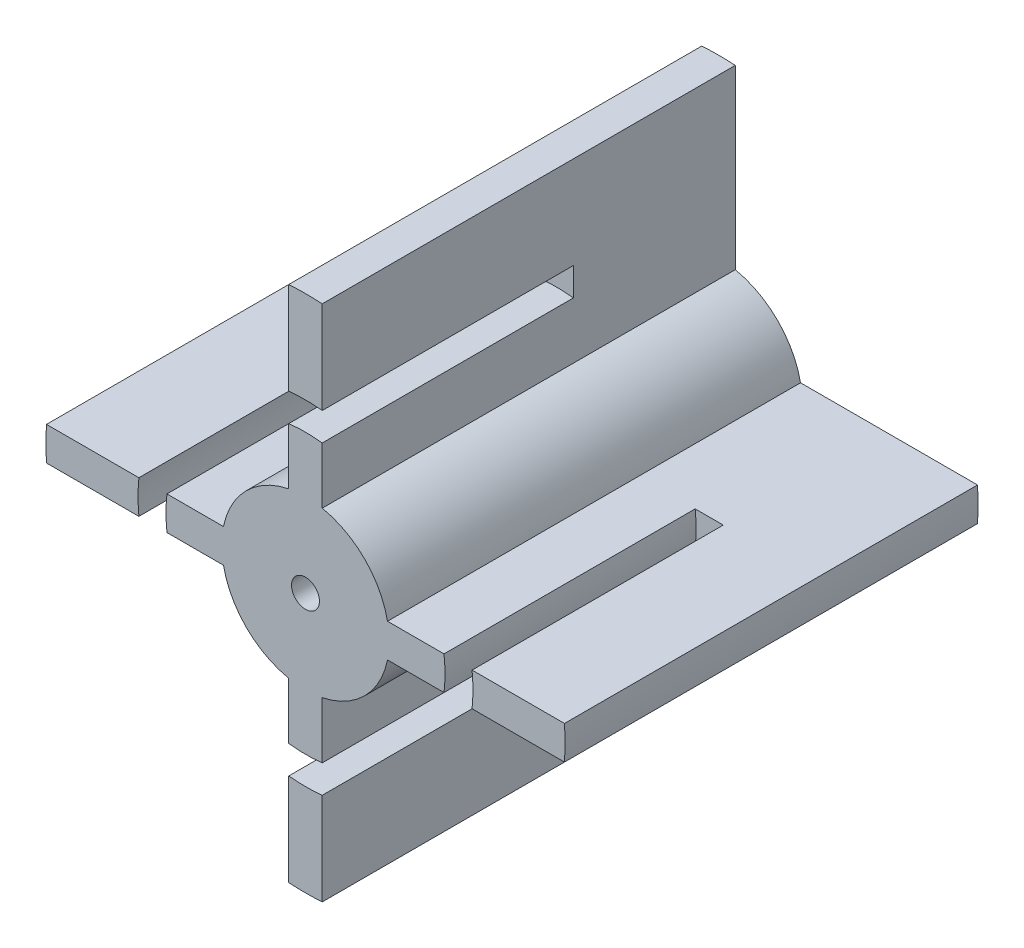
ISO-10303-21;
HEADER;
FILE_DESCRIPTION(('STEP AP214'),'2;1');
FILE_NAME('part.step','',(''),(''),'','','');
FILE_SCHEMA(('AUTOMOTIVE_DESIGN { 1 0 10303 214 1 1 1 1 }'));
ENDSEC;
DATA;
#1=APPLICATION_CONTEXT('core data for automotive mechanical design processes');
#2=APPLICATION_PROTOCOL_DEFINITION('international standard','automotive_design',2000,#1);
#3=PRODUCT_CONTEXT('',#1,'mechanical');
#4=PRODUCT('Part','Part','',(#3));
#5=PRODUCT_RELATED_PRODUCT_CATEGORY('part','',(#4));
#6=PRODUCT_DEFINITION_FORMATION('','',#4);
#7=PRODUCT_DEFINITION_CONTEXT('part definition',#1,'design');
#8=PRODUCT_DEFINITION('design','',#6,#7);
#9=PRODUCT_DEFINITION_SHAPE('','',#8);
#10=(LENGTH_UNIT() NAMED_UNIT(*) SI_UNIT(.MILLI.,.METRE.));
#11=(NAMED_UNIT(*) PLANE_ANGLE_UNIT() SI_UNIT($,.RADIAN.));
#12=(NAMED_UNIT(*) SI_UNIT($,.STERADIAN.) SOLID_ANGLE_UNIT());
#13=UNCERTAINTY_MEASURE_WITH_UNIT(LENGTH_MEASURE(1.E-05),#10,'distance_accuracy_value','');
#14=(GEOMETRIC_REPRESENTATION_CONTEXT(3) GLOBAL_UNCERTAINTY_ASSIGNED_CONTEXT((#13)) GLOBAL_UNIT_ASSIGNED_CONTEXT((#10,
#11,#12)) REPRESENTATION_CONTEXT('',''));
#15=CARTESIAN_POINT('',(0.,0.,0.));
#16=DIRECTION('',(0.,0.,1.));
#17=DIRECTION('',(1.,0.,0.));
#18=AXIS2_PLACEMENT_3D('',#15,#16,#17);
#19=CARTESIAN_POINT('',(0.,0.,74.));
#20=DIRECTION('',(0.,0.,1.));
#21=DIRECTION('',(1.,0.,0.));
#22=AXIS2_PLACEMENT_3D('',#19,#20,#21);
#23=PLANE('',#22);
#24=CARTESIAN_POINT('',(0.,0.,74.));
#25=DIRECTION('',(0.,0.,1.));
#26=DIRECTION('',(1.,0.,0.));
#27=AXIS2_PLACEMENT_3D('',#24,#25,#26);
#28=CIRCLE('',#27,2.5);
#29=CARTESIAN_POINT('',(2.5,0.,74.));
#30=VERTEX_POINT('',#29);
#31=EDGE_CURVE('E280',#30,#30,#28,.T.);
#32=ORIENTED_EDGE('',*,*,#31,.F.);
#33=EDGE_LOOP('',(#32));
#34=FACE_BOUND('',#33,.T.);
#35=DIRECTION('',(0.,-1.,0.));
#36=VECTOR('',#35,1.);
#37=CARTESIAN_POINT('',(3.,14.6969384566991,74.));
#38=LINE('',#37,#36);
#39=CARTESIAN_POINT('',(3.,24.8193472919817,74.));
#40=VERTEX_POINT('',#39);
#41=CARTESIAN_POINT('',(3.,14.6969384566991,74.));
#42=VERTEX_POINT('',#41);
#43=EDGE_CURVE('E378',#40,#42,#38,.T.);
#44=ORIENTED_EDGE('',*,*,#43,.F.);
#45=CARTESIAN_POINT('',(0.,0.,74.));
#46=DIRECTION('',(0.,0.,1.));
#47=DIRECTION('',(1.,0.,0.));
#48=AXIS2_PLACEMENT_3D('',#45,#46,#47);
#49=CIRCLE('',#48,25.);
#50=CARTESIAN_POINT('',(-3.,24.8193472919817,74.));
#51=VERTEX_POINT('',#50);
#52=EDGE_CURVE('E250',#40,#51,#49,.T.);
#53=ORIENTED_EDGE('',*,*,#52,.T.);
#54=DIRECTION('',(0.,1.,0.));
#55=VECTOR('',#54,1.);
#56=CARTESIAN_POINT('',(-3.,46.4031248947741,74.));
#57=LINE('',#56,#55);
#58=CARTESIAN_POINT('',(-3.,14.6969384566991,74.));
#59=VERTEX_POINT('',#58);
#60=EDGE_CURVE('E379',#59,#51,#57,.T.);
#61=ORIENTED_EDGE('',*,*,#60,.F.);
#62=CARTESIAN_POINT('',(0.,0.,74.));
#63=DIRECTION('',(0.,0.,-1.));
#64=DIRECTION('',(-1.,0.,0.));
#65=AXIS2_PLACEMENT_3D('',#62,#63,#64);
#66=CIRCLE('',#65,15.);
#67=CARTESIAN_POINT('',(-14.6969384566991,3.,74.));
#68=VERTEX_POINT('',#67);
#69=EDGE_CURVE('E383',#68,#59,#66,.T.);
#70=ORIENTED_EDGE('',*,*,#69,.F.);
#71=DIRECTION('',(1.,0.,0.));
#72=VECTOR('',#71,1.);
#73=CARTESIAN_POINT('',(-14.6969384566991,3.,74.));
#74=LINE('',#73,#72);
#75=CARTESIAN_POINT('',(-24.8193472919817,3.,74.));
#76=VERTEX_POINT('',#75);
#77=EDGE_CURVE('E389',#76,#68,#74,.T.);
#78=ORIENTED_EDGE('',*,*,#77,.F.);
#79=CARTESIAN_POINT('',(-24.8193472919817,-3.,74.));
#80=VERTEX_POINT('',#79);
#81=EDGE_CURVE('E59',#76,#80,#49,.T.);
#82=ORIENTED_EDGE('',*,*,#81,.T.);
#83=DIRECTION('',(-1.,0.,0.));
#84=VECTOR('',#83,1.);
#85=CARTESIAN_POINT('',(-46.4031248947741,-3.,74.));
#86=LINE('',#85,#84);
#87=CARTESIAN_POINT('',(-14.6969384566991,-3.,74.));
#88=VERTEX_POINT('',#87);
#89=EDGE_CURVE('E390',#88,#80,#86,.T.);
#90=ORIENTED_EDGE('',*,*,#89,.F.);
#91=CARTESIAN_POINT('',(0.,0.,74.));
#92=DIRECTION('',(0.,0.,-1.));
#93=DIRECTION('',(-1.,0.,0.));
#94=AXIS2_PLACEMENT_3D('',#91,#92,#93);
#95=CIRCLE('',#94,15.);
#96=CARTESIAN_POINT('',(-3.,-14.6969384566991,74.));
#97=VERTEX_POINT('',#96);
#98=EDGE_CURVE('E394',#97,#88,#95,.T.);
#99=ORIENTED_EDGE('',*,*,#98,.F.);
#100=DIRECTION('',(0.,1.,0.));
#101=VECTOR('',#100,1.);
#102=CARTESIAN_POINT('',(-3.,-46.4031248947741,74.));
#103=LINE('',#102,#101);
#104=CARTESIAN_POINT('',(-3.,-24.8193472919817,74.));
#105=VERTEX_POINT('',#104);
#106=EDGE_CURVE('E400',#105,#97,#103,.T.);
#107=ORIENTED_EDGE('',*,*,#106,.F.);
#108=CARTESIAN_POINT('',(3.,-24.8193472919817,74.));
#109=VERTEX_POINT('',#108);
#110=EDGE_CURVE('E51',#105,#109,#49,.T.);
#111=ORIENTED_EDGE('',*,*,#110,.T.);
#112=DIRECTION('',(0.,-1.,0.));
#113=VECTOR('',#112,1.);
#114=CARTESIAN_POINT('',(3.,-14.6969384566991,74.));
#115=LINE('',#114,#113);
#116=CARTESIAN_POINT('',(3.,-14.6969384566991,74.));
#117=VERTEX_POINT('',#116);
#118=EDGE_CURVE('E401',#117,#109,#115,.T.);
#119=ORIENTED_EDGE('',*,*,#118,.F.);
#120=CARTESIAN_POINT('',(0.,0.,74.));
#121=DIRECTION('',(0.,0.,-1.));
#122=DIRECTION('',(-1.,0.,0.));
#123=AXIS2_PLACEMENT_3D('',#120,#121,#122);
#124=CIRCLE('',#123,15.);
#125=CARTESIAN_POINT('',(14.6969384566991,-3.,74.));
#126=VERTEX_POINT('',#125);
#127=EDGE_CURVE('E405',#126,#117,#124,.T.);
#128=ORIENTED_EDGE('',*,*,#127,.F.);
#129=DIRECTION('',(-1.,0.,0.));
#130=VECTOR('',#129,1.);
#131=CARTESIAN_POINT('',(14.6969384566991,-3.,74.));
#132=LINE('',#131,#130);
#133=CARTESIAN_POINT('',(24.8193472919817,-3.,74.));
#134=VERTEX_POINT('',#133);
#135=EDGE_CURVE('E335',#134,#126,#132,.T.);
#136=ORIENTED_EDGE('',*,*,#135,.F.);
#137=CARTESIAN_POINT('',(24.8193472919817,3.,74.));
#138=VERTEX_POINT('',#137);
#139=EDGE_CURVE('E469',#134,#138,#49,.T.);
#140=ORIENTED_EDGE('',*,*,#139,.T.);
#141=DIRECTION('',(1.,0.,0.));
#142=VECTOR('',#141,1.);
#143=CARTESIAN_POINT('',(46.4031248947741,3.,74.));
#144=LINE('',#143,#142);
#145=CARTESIAN_POINT('',(14.6969384566991,3.,74.));
#146=VERTEX_POINT('',#145);
#147=EDGE_CURVE('E296',#146,#138,#144,.T.);
#148=ORIENTED_EDGE('',*,*,#147,.F.);
#149=CARTESIAN_POINT('',(0.,0.,74.));
#150=DIRECTION('',(0.,0.,-1.));
#151=DIRECTION('',(-1.,0.,0.));
#152=AXIS2_PLACEMENT_3D('',#149,#150,#151);
#153=CIRCLE('',#152,15.);
#154=EDGE_CURVE('E373',#42,#146,#153,.T.);
#155=ORIENTED_EDGE('',*,*,#154,.F.);
#156=EDGE_LOOP('',(#44,#53,#61,#70,#78,#82,#90,#99,#107,#111,#119,#128,#136,#140,#148,#155));
#157=FACE_BOUND('',#156,.T.);
#158=ADVANCED_FACE('F36',(#34,#157),#23,.T.);
#159=CARTESIAN_POINT('',(0.,0.,74.));
#160=DIRECTION('',(0.,0.,1.));
#161=DIRECTION('',(1.,0.,0.));
#162=AXIS2_PLACEMENT_3D('',#159,#160,#161);
#163=CIRCLE('',#162,30.);
#164=CARTESIAN_POINT('',(3.,29.8496231131986,74.));
#165=VERTEX_POINT('',#164);
#166=CARTESIAN_POINT('',(-3.,29.8496231131986,74.));
#167=VERTEX_POINT('',#166);
#168=EDGE_CURVE('E464',#165,#167,#163,.T.);
#169=ORIENTED_EDGE('',*,*,#168,.F.);
#170=CARTESIAN_POINT('',(3.,46.4031248947741,74.));
#171=VERTEX_POINT('',#170);
#172=EDGE_CURVE('E376',#171,#165,#38,.T.);
#173=ORIENTED_EDGE('',*,*,#172,.F.);
#174=CARTESIAN_POINT('',(0.,0.,74.));
#175=DIRECTION('',(0.,0.,1.));
#176=DIRECTION('',(1.,0.,0.));
#177=AXIS2_PLACEMENT_3D('',#174,#175,#176);
#178=CIRCLE('',#177,46.5);
#179=CARTESIAN_POINT('',(-3.,46.4031248947741,74.));
#180=VERTEX_POINT('',#179);
#181=EDGE_CURVE('E254',#171,#180,#178,.T.);
#182=ORIENTED_EDGE('',*,*,#181,.T.);
#183=EDGE_CURVE('E382',#167,#180,#57,.T.);
#184=ORIENTED_EDGE('',*,*,#183,.F.);
#185=EDGE_LOOP('',(#169,#173,#182,#184));
#186=FACE_BOUND('',#185,.T.);
#187=ADVANCED_FACE('F559',(#186),#23,.T.);
#188=CARTESIAN_POINT('',(-29.8496231131986,3.,74.));
#189=VERTEX_POINT('',#188);
#190=CARTESIAN_POINT('',(-29.8496231131986,-3.,74.));
#191=VERTEX_POINT('',#190);
#192=EDGE_CURVE('E589',#189,#191,#163,.T.);
#193=ORIENTED_EDGE('',*,*,#192,.F.);
#194=CARTESIAN_POINT('',(-46.4031248947741,3.,74.));
#195=VERTEX_POINT('',#194);
#196=EDGE_CURVE('E386',#195,#189,#74,.T.);
#197=ORIENTED_EDGE('',*,*,#196,.F.);
#198=CARTESIAN_POINT('',(-46.4031248947741,-3.00000000000002,74.));
#199=VERTEX_POINT('',#198);
#200=EDGE_CURVE('E607',#195,#199,#178,.T.);
#201=ORIENTED_EDGE('',*,*,#200,.T.);
#202=EDGE_CURVE('E393',#191,#199,#86,.T.);
#203=ORIENTED_EDGE('',*,*,#202,.F.);
#204=EDGE_LOOP('',(#193,#197,#201,#203));
#205=FACE_BOUND('',#204,.T.);
#206=ADVANCED_FACE('F565',(#205),#23,.T.);
#207=CARTESIAN_POINT('',(-3.,-29.8496231131986,74.));
#208=VERTEX_POINT('',#207);
#209=CARTESIAN_POINT('',(3.,-29.8496231131986,74.));
#210=VERTEX_POINT('',#209);
#211=EDGE_CURVE('E463',#208,#210,#163,.T.);
#212=ORIENTED_EDGE('',*,*,#211,.F.);
#213=CARTESIAN_POINT('',(-3.,-46.4031248947741,74.));
#214=VERTEX_POINT('',#213);
#215=EDGE_CURVE('E397',#214,#208,#103,.T.);
#216=ORIENTED_EDGE('',*,*,#215,.F.);
#217=CARTESIAN_POINT('',(3.00000000000001,-46.4031248947741,74.));
#218=VERTEX_POINT('',#217);
#219=EDGE_CURVE('E279',#214,#218,#178,.T.);
#220=ORIENTED_EDGE('',*,*,#219,.T.);
#221=EDGE_CURVE('E404',#210,#218,#115,.T.);
#222=ORIENTED_EDGE('',*,*,#221,.F.);
#223=EDGE_LOOP('',(#212,#216,#220,#222));
#224=FACE_BOUND('',#223,.T.);
#225=ADVANCED_FACE('F570',(#224),#23,.T.);
#226=CARTESIAN_POINT('',(0.,0.,74.));
#227=DIRECTION('',(0.,0.,-1.));
#228=DIRECTION('',(-1.,0.,0.));
#229=AXIS2_PLACEMENT_3D('',#226,#227,#228);
#230=CYLINDRICAL_SURFACE('',#229,46.5);
#231=DIRECTION('',(0.,0.,-1.));
#232=VECTOR('',#231,1.);
#233=CARTESIAN_POINT('',(46.4031248947741,3.,74.));
#234=LINE('',#233,#232);
#235=CARTESIAN_POINT('',(46.4031248947741,3.,74.));
#236=VERTEX_POINT('',#235);
#237=CARTESIAN_POINT('',(46.4031248947741,3.,0.));
#238=VERTEX_POINT('',#237);
#239=EDGE_CURVE('E289',#236,#238,#234,.T.);
#240=ORIENTED_EDGE('',*,*,#239,.F.);
#241=CARTESIAN_POINT('',(46.4031248947741,-3.,74.));
#242=VERTEX_POINT('',#241);
#243=EDGE_CURVE('E276',#242,#236,#178,.T.);
#244=ORIENTED_EDGE('',*,*,#243,.F.);
#245=DIRECTION('',(0.,0.,-1.));
#246=VECTOR('',#245,1.);
#247=CARTESIAN_POINT('',(46.4031248947741,-3.,74.));
#248=LINE('',#247,#246);
#249=CARTESIAN_POINT('',(46.4031248947741,-3.,0.));
#250=VERTEX_POINT('',#249);
#251=EDGE_CURVE('E292',#242,#250,#248,.T.);
#252=ORIENTED_EDGE('',*,*,#251,.T.);
#253=CARTESIAN_POINT('',(0.,0.,0.));
#254=DIRECTION('',(0.,0.,1.));
#255=DIRECTION('',(1.,0.,0.));
#256=AXIS2_PLACEMENT_3D('',#253,#254,#255);
#257=CIRCLE('',#256,46.5);
#258=EDGE_CURVE('E270',#250,#238,#257,.T.);
#259=ORIENTED_EDGE('',*,*,#258,.T.);
#260=EDGE_LOOP('',(#240,#244,#252,#259));
#261=FACE_BOUND('',#260,.T.);
#262=ADVANCED_FACE('F38',(#261),#230,.T.);
#263=DIRECTION('',(0.,0.,-1.));
#264=VECTOR('',#263,1.);
#265=CARTESIAN_POINT('',(3.,46.4031248947741,74.));
#266=LINE('',#265,#264);
#267=CARTESIAN_POINT('',(3.,46.4031248947741,0.));
#268=VERTEX_POINT('',#267);
#269=EDGE_CURVE('E323',#171,#268,#266,.T.);
#270=ORIENTED_EDGE('',*,*,#269,.T.);
#271=CARTESIAN_POINT('',(-3.,46.4031248947741,0.));
#272=VERTEX_POINT('',#271);
#273=EDGE_CURVE('E275',#268,#272,#257,.T.);
#274=ORIENTED_EDGE('',*,*,#273,.T.);
#275=DIRECTION('',(0.,0.,-1.));
#276=VECTOR('',#275,1.);
#277=CARTESIAN_POINT('',(-3.,46.4031248947741,74.));
#278=LINE('',#277,#276);
#279=EDGE_CURVE('E321',#180,#272,#278,.T.);
#280=ORIENTED_EDGE('',*,*,#279,.F.);
#281=ORIENTED_EDGE('',*,*,#181,.F.);
#282=EDGE_LOOP('',(#270,#274,#280,#281));
#283=FACE_BOUND('',#282,.T.);
#284=ADVANCED_FACE('F584',(#283),#230,.T.);
#285=DIRECTION('',(0.,0.,-1.));
#286=VECTOR('',#285,1.);
#287=CARTESIAN_POINT('',(-46.4031248947741,3.,74.));
#288=LINE('',#287,#286);
#289=CARTESIAN_POINT('',(-46.4031248947741,3.,0.));
#290=VERTEX_POINT('',#289);
#291=EDGE_CURVE('E313',#195,#290,#288,.T.);
#292=ORIENTED_EDGE('',*,*,#291,.T.);
#293=CARTESIAN_POINT('',(-46.4031248947741,-3.00000000000002,0.));
#294=VERTEX_POINT('',#293);
#295=EDGE_CURVE('E515',#290,#294,#257,.T.);
#296=ORIENTED_EDGE('',*,*,#295,.T.);
#297=DIRECTION('',(0.,0.,-1.));
#298=VECTOR('',#297,1.);
#299=CARTESIAN_POINT('',(-46.4031248947741,-3.00000000000002,74.));
#300=LINE('',#299,#298);
#301=EDGE_CURVE('E311',#199,#294,#300,.T.);
#302=ORIENTED_EDGE('',*,*,#301,.F.);
#303=ORIENTED_EDGE('',*,*,#200,.F.);
#304=EDGE_LOOP('',(#292,#296,#302,#303));
#305=FACE_BOUND('',#304,.T.);
#306=ADVANCED_FACE('F577',(#305),#230,.T.);
#307=DIRECTION('',(0.,0.,-1.));
#308=VECTOR('',#307,1.);
#309=CARTESIAN_POINT('',(-3.,-46.4031248947741,74.));
#310=LINE('',#309,#308);
#311=CARTESIAN_POINT('',(-3.,-46.4031248947741,0.));
#312=VERTEX_POINT('',#311);
#313=EDGE_CURVE('E303',#214,#312,#310,.T.);
#314=ORIENTED_EDGE('',*,*,#313,.T.);
#315=CARTESIAN_POINT('',(3.00000000000001,-46.4031248947741,0.));
#316=VERTEX_POINT('',#315);
#317=EDGE_CURVE('E273',#312,#316,#257,.T.);
#318=ORIENTED_EDGE('',*,*,#317,.T.);
#319=DIRECTION('',(0.,0.,-1.));
#320=VECTOR('',#319,1.);
#321=CARTESIAN_POINT('',(3.00000000000001,-46.4031248947741,74.));
#322=LINE('',#321,#320);
#323=EDGE_CURVE('E301',#218,#316,#322,.T.);
#324=ORIENTED_EDGE('',*,*,#323,.F.);
#325=ORIENTED_EDGE('',*,*,#219,.F.);
#326=EDGE_LOOP('',(#314,#318,#324,#325));
#327=FACE_BOUND('',#326,.T.);
#328=ADVANCED_FACE('F524',(#327),#230,.T.);
#329=CARTESIAN_POINT('',(29.8496231131986,-3.,74.));
#330=VERTEX_POINT('',#329);
#331=CARTESIAN_POINT('',(29.8496231131986,3.,74.));
#332=VERTEX_POINT('',#331);
#333=EDGE_CURVE('E262',#330,#332,#163,.T.);
#334=ORIENTED_EDGE('',*,*,#333,.F.);
#335=EDGE_CURVE('E408',#242,#330,#132,.T.);
#336=ORIENTED_EDGE('',*,*,#335,.F.);
#337=ORIENTED_EDGE('',*,*,#243,.T.);
#338=EDGE_CURVE('E372',#332,#236,#144,.T.);
#339=ORIENTED_EDGE('',*,*,#338,.F.);
#340=EDGE_LOOP('',(#334,#336,#337,#339));
#341=FACE_BOUND('',#340,.T.);
#342=ADVANCED_FACE('F535',(#341),#23,.T.);
#343=CARTESIAN_POINT('',(0.,0.,0.));
#344=DIRECTION('',(0.,0.,1.));
#345=DIRECTION('',(1.,0.,0.));
#346=AXIS2_PLACEMENT_3D('',#343,#344,#345);
#347=PLANE('',#346);
#348=CARTESIAN_POINT('',(0.,0.,0.));
#349=DIRECTION('',(0.,0.,-1.));
#350=DIRECTION('',(-1.,0.,0.));
#351=AXIS2_PLACEMENT_3D('',#348,#349,#350);
#352=CIRCLE('',#351,2.5);
#353=CARTESIAN_POINT('',(-2.5,0.,0.));
#354=VERTEX_POINT('',#353);
#355=EDGE_CURVE('E286',#354,#354,#352,.T.);
#356=ORIENTED_EDGE('',*,*,#355,.F.);
#357=EDGE_LOOP('',(#356));
#358=FACE_BOUND('',#357,.T.);
#359=DIRECTION('',(1.,0.,0.));
#360=VECTOR('',#359,1.);
#361=CARTESIAN_POINT('',(46.4031248947741,3.,0.));
#362=LINE('',#361,#360);
#363=CARTESIAN_POINT('',(14.6969384566991,3.,0.));
#364=VERTEX_POINT('',#363);
#365=EDGE_CURVE('E332',#364,#238,#362,.T.);
#366=ORIENTED_EDGE('',*,*,#365,.T.);
#367=ORIENTED_EDGE('',*,*,#258,.F.);
#368=DIRECTION('',(-1.,0.,0.));
#369=VECTOR('',#368,1.);
#370=CARTESIAN_POINT('',(14.6969384566991,-3.,0.));
#371=LINE('',#370,#369);
#372=CARTESIAN_POINT('',(14.6969384566991,-3.,0.));
#373=VERTEX_POINT('',#372);
#374=EDGE_CURVE('E366',#250,#373,#371,.T.);
#375=ORIENTED_EDGE('',*,*,#374,.T.);
#376=CARTESIAN_POINT('',(0.,0.,0.));
#377=DIRECTION('',(0.,0.,-1.));
#378=DIRECTION('',(-1.,0.,0.));
#379=AXIS2_PLACEMENT_3D('',#376,#377,#378);
#380=CIRCLE('',#379,15.);
#381=CARTESIAN_POINT('',(3.,-14.6969384566991,0.));
#382=VERTEX_POINT('',#381);
#383=EDGE_CURVE('E363',#373,#382,#380,.T.);
#384=ORIENTED_EDGE('',*,*,#383,.T.);
#385=DIRECTION('',(0.,-1.,0.));
#386=VECTOR('',#385,1.);
#387=CARTESIAN_POINT('',(3.,-14.6969384566991,0.));
#388=LINE('',#387,#386);
#389=EDGE_CURVE('E360',#382,#316,#388,.T.);
#390=ORIENTED_EDGE('',*,*,#389,.T.);
#391=ORIENTED_EDGE('',*,*,#317,.F.);
#392=DIRECTION('',(0.,1.,0.));
#393=VECTOR('',#392,1.);
#394=CARTESIAN_POINT('',(-3.,-46.4031248947741,0.));
#395=LINE('',#394,#393);
#396=CARTESIAN_POINT('',(-3.,-14.6969384566991,0.));
#397=VERTEX_POINT('',#396);
#398=EDGE_CURVE('E357',#312,#397,#395,.T.);
#399=ORIENTED_EDGE('',*,*,#398,.T.);
#400=CARTESIAN_POINT('',(0.,0.,0.));
#401=DIRECTION('',(0.,0.,-1.));
#402=DIRECTION('',(-1.,0.,0.));
#403=AXIS2_PLACEMENT_3D('',#400,#401,#402);
#404=CIRCLE('',#403,15.);
#405=CARTESIAN_POINT('',(-14.6969384566991,-3.,0.));
#406=VERTEX_POINT('',#405);
#407=EDGE_CURVE('E354',#397,#406,#404,.T.);
#408=ORIENTED_EDGE('',*,*,#407,.T.);
#409=DIRECTION('',(-1.,0.,0.));
#410=VECTOR('',#409,1.);
#411=CARTESIAN_POINT('',(-46.4031248947741,-3.,0.));
#412=LINE('',#411,#410);
#413=EDGE_CURVE('E351',#406,#294,#412,.T.);
#414=ORIENTED_EDGE('',*,*,#413,.T.);
#415=ORIENTED_EDGE('',*,*,#295,.F.);
#416=DIRECTION('',(1.,0.,0.));
#417=VECTOR('',#416,1.);
#418=CARTESIAN_POINT('',(-14.6969384566991,3.,0.));
#419=LINE('',#418,#417);
#420=CARTESIAN_POINT('',(-14.6969384566991,3.,0.));
#421=VERTEX_POINT('',#420);
#422=EDGE_CURVE('E348',#290,#421,#419,.T.);
#423=ORIENTED_EDGE('',*,*,#422,.T.);
#424=CARTESIAN_POINT('',(0.,0.,0.));
#425=DIRECTION('',(0.,0.,-1.));
#426=DIRECTION('',(-1.,0.,0.));
#427=AXIS2_PLACEMENT_3D('',#424,#425,#426);
#428=CIRCLE('',#427,15.);
#429=CARTESIAN_POINT('',(-3.,14.6969384566991,0.));
#430=VERTEX_POINT('',#429);
#431=EDGE_CURVE('E345',#421,#430,#428,.T.);
#432=ORIENTED_EDGE('',*,*,#431,.T.);
#433=DIRECTION('',(0.,1.,0.));
#434=VECTOR('',#433,1.);
#435=CARTESIAN_POINT('',(-3.,46.4031248947741,0.));
#436=LINE('',#435,#434);
#437=EDGE_CURVE('E342',#430,#272,#436,.T.);
#438=ORIENTED_EDGE('',*,*,#437,.T.);
#439=ORIENTED_EDGE('',*,*,#273,.F.);
#440=DIRECTION('',(0.,-1.,0.));
#441=VECTOR('',#440,1.);
#442=CARTESIAN_POINT('',(3.,14.6969384566991,0.));
#443=LINE('',#442,#441);
#444=CARTESIAN_POINT('',(3.,14.6969384566991,0.));
#445=VERTEX_POINT('',#444);
#446=EDGE_CURVE('E339',#268,#445,#443,.T.);
#447=ORIENTED_EDGE('',*,*,#446,.T.);
#448=CARTESIAN_POINT('',(0.,0.,0.));
#449=DIRECTION('',(0.,0.,-1.));
#450=DIRECTION('',(-1.,0.,0.));
#451=AXIS2_PLACEMENT_3D('',#448,#449,#450);
#452=CIRCLE('',#451,15.);
#453=EDGE_CURVE('E336',#445,#364,#452,.T.);
#454=ORIENTED_EDGE('',*,*,#453,.T.);
#455=EDGE_LOOP('',(#366,#367,#375,#384,#390,#391,#399,#408,#414,#415,#423,#432,#438,#439,#447,#454));
#456=FACE_BOUND('',#455,.T.);
#457=ADVANCED_FACE('F510',(#358,#456),#347,.F.);
#458=CARTESIAN_POINT('',(0.,0.,64.));
#459=DIRECTION('',(0.,0.,1.));
#460=DIRECTION('',(1.,0.,0.));
#461=AXIS2_PLACEMENT_3D('',#458,#459,#460);
#462=CYLINDRICAL_SURFACE('',#461,2.5);
#463=CARTESIAN_POINT('',(0.,0.,64.));
#464=DIRECTION('',(0.,0.,1.));
#465=DIRECTION('',(1.,0.,0.));
#466=AXIS2_PLACEMENT_3D('',#463,#464,#465);
#467=CIRCLE('',#466,2.5);
#468=CARTESIAN_POINT('',(2.5,0.,64.));
#469=VERTEX_POINT('',#468);
#470=EDGE_CURVE('E274',#469,#469,#467,.T.);
#471=ORIENTED_EDGE('',*,*,#470,.F.);
#472=EDGE_LOOP('',(#471));
#473=FACE_BOUND('',#472,.T.);
#474=ORIENTED_EDGE('',*,*,#31,.T.);
#475=EDGE_LOOP('',(#474));
#476=FACE_BOUND('',#475,.T.);
#477=ADVANCED_FACE('F575',(#473,#476),#462,.F.);
#478=CARTESIAN_POINT('',(0.,0.,64.));
#479=DIRECTION('',(0.,0.,1.));
#480=DIRECTION('',(1.,0.,0.));
#481=AXIS2_PLACEMENT_3D('',#478,#479,#480);
#482=PLANE('',#481);
#483=ORIENTED_EDGE('',*,*,#470,.T.);
#484=EDGE_LOOP('',(#483));
#485=FACE_BOUND('',#484,.T.);
#486=ADVANCED_FACE('F670',(#485),#482,.T.);
#487=CARTESIAN_POINT('',(0.,0.,10.));
#488=DIRECTION('',(0.,0.,-1.));
#489=DIRECTION('',(-1.,0.,0.));
#490=AXIS2_PLACEMENT_3D('',#487,#488,#489);
#491=CYLINDRICAL_SURFACE('',#490,2.5);
#492=CARTESIAN_POINT('',(0.,0.,10.));
#493=DIRECTION('',(0.,0.,-1.));
#494=DIRECTION('',(-1.,0.,0.));
#495=AXIS2_PLACEMENT_3D('',#492,#493,#494);
#496=CIRCLE('',#495,2.5);
#497=CARTESIAN_POINT('',(-2.5,0.,10.));
#498=VERTEX_POINT('',#497);
#499=EDGE_CURVE('E283',#498,#498,#496,.T.);
#500=ORIENTED_EDGE('',*,*,#499,.F.);
#501=EDGE_LOOP('',(#500));
#502=FACE_BOUND('',#501,.T.);
#503=ORIENTED_EDGE('',*,*,#355,.T.);
#504=EDGE_LOOP('',(#503));
#505=FACE_BOUND('',#504,.T.);
#506=ADVANCED_FACE('F666',(#502,#505),#491,.F.);
#507=CARTESIAN_POINT('',(0.,0.,10.));
#508=DIRECTION('',(0.,0.,-1.));
#509=DIRECTION('',(-1.,0.,0.));
#510=AXIS2_PLACEMENT_3D('',#507,#508,#509);
#511=PLANE('',#510);
#512=ORIENTED_EDGE('',*,*,#499,.T.);
#513=EDGE_LOOP('',(#512));
#514=FACE_BOUND('',#513,.T.);
#515=ADVANCED_FACE('F663',(#514),#511,.T.);
#516=CARTESIAN_POINT('',(14.6969384566991,-3.,74.));
#517=DIRECTION('',(0.,-1.,0.));
#518=DIRECTION('',(1.,0.,0.));
#519=AXIS2_PLACEMENT_3D('',#516,#517,#518);
#520=PLANE('',#519);
#521=DIRECTION('',(0.,0.,1.));
#522=VECTOR('',#521,1.);
#523=CARTESIAN_POINT('',(29.8496231131986,-3.,29.));
#524=LINE('',#523,#522);
#525=CARTESIAN_POINT('',(29.8496231131986,-3.,29.));
#526=VERTEX_POINT('',#525);
#527=EDGE_CURVE('E369',#526,#330,#524,.T.);
#528=ORIENTED_EDGE('',*,*,#527,.F.);
#529=DIRECTION('',(-1.,0.,0.));
#530=VECTOR('',#529,1.);
#531=CARTESIAN_POINT('',(14.6969384566991,-3.,29.));
#532=LINE('',#531,#530);
#533=CARTESIAN_POINT('',(24.8193472919817,-3.,29.));
#534=VERTEX_POINT('',#533);
#535=EDGE_CURVE('E424',#526,#534,#532,.T.);
#536=ORIENTED_EDGE('',*,*,#535,.T.);
#537=DIRECTION('',(0.,0.,1.));
#538=VECTOR('',#537,1.);
#539=CARTESIAN_POINT('',(24.8193472919817,-3.,29.));
#540=LINE('',#539,#538);
#541=EDGE_CURVE('E443',#534,#134,#540,.T.);
#542=ORIENTED_EDGE('',*,*,#541,.T.);
#543=ORIENTED_EDGE('',*,*,#135,.T.);
#544=DIRECTION('',(0.,0.,-1.));
#545=VECTOR('',#544,1.);
#546=CARTESIAN_POINT('',(14.6969384566991,-2.99999999999999,74.));
#547=LINE('',#546,#545);
#548=EDGE_CURVE('E295',#126,#373,#547,.T.);
#549=ORIENTED_EDGE('',*,*,#548,.T.);
#550=ORIENTED_EDGE('',*,*,#374,.F.);
#551=ORIENTED_EDGE('',*,*,#251,.F.);
#552=ORIENTED_EDGE('',*,*,#335,.T.);
#553=EDGE_LOOP('',(#528,#536,#542,#543,#549,#550,#551,#552));
#554=FACE_BOUND('',#553,.T.);
#555=ADVANCED_FACE('F495',(#554),#520,.T.);
#556=CARTESIAN_POINT('',(0.,0.,74.));
#557=DIRECTION('',(0.,0.,-1.));
#558=DIRECTION('',(-1.,0.,0.));
#559=AXIS2_PLACEMENT_3D('',#556,#557,#558);
#560=CYLINDRICAL_SURFACE('',#559,15.);
#561=ORIENTED_EDGE('',*,*,#383,.F.);
#562=ORIENTED_EDGE('',*,*,#548,.F.);
#563=ORIENTED_EDGE('',*,*,#127,.T.);
#564=DIRECTION('',(0.,0.,-1.));
#565=VECTOR('',#564,1.);
#566=CARTESIAN_POINT('',(3.,-14.6969384566991,74.));
#567=LINE('',#566,#565);
#568=EDGE_CURVE('E299',#117,#382,#567,.T.);
#569=ORIENTED_EDGE('',*,*,#568,.T.);
#570=EDGE_LOOP('',(#561,#562,#563,#569));
#571=FACE_BOUND('',#570,.T.);
#572=ADVANCED_FACE('F490',(#571),#560,.T.);
#573=CARTESIAN_POINT('',(3.,-14.6969384566991,74.));
#574=DIRECTION('',(1.,0.,0.));
#575=DIRECTION('',(0.,1.,0.));
#576=AXIS2_PLACEMENT_3D('',#573,#574,#575);
#577=PLANE('',#576);
#578=DIRECTION('',(0.,0.,1.));
#579=VECTOR('',#578,1.);
#580=CARTESIAN_POINT('',(3.,-29.8496231131986,29.));
#581=LINE('',#580,#579);
#582=CARTESIAN_POINT('',(3.,-29.8496231131986,29.));
#583=VERTEX_POINT('',#582);
#584=EDGE_CURVE('E412',#210,#583,#581,.F.);
#585=ORIENTED_EDGE('',*,*,#584,.F.);
#586=ORIENTED_EDGE('',*,*,#221,.T.);
#587=ORIENTED_EDGE('',*,*,#323,.T.);
#588=ORIENTED_EDGE('',*,*,#389,.F.);
#589=ORIENTED_EDGE('',*,*,#568,.F.);
#590=ORIENTED_EDGE('',*,*,#118,.T.);
#591=DIRECTION('',(0.,0.,1.));
#592=VECTOR('',#591,1.);
#593=CARTESIAN_POINT('',(3.,-24.8193472919817,29.));
#594=LINE('',#593,#592);
#595=CARTESIAN_POINT('',(3.,-24.8193472919817,29.));
#596=VERTEX_POINT('',#595);
#597=EDGE_CURVE('E446',#109,#596,#594,.F.);
#598=ORIENTED_EDGE('',*,*,#597,.T.);
#599=DIRECTION('',(0.,-1.,0.));
#600=VECTOR('',#599,1.);
#601=CARTESIAN_POINT('',(3.,-14.6969384566991,29.));
#602=LINE('',#601,#600);
#603=EDGE_CURVE('E427',#596,#583,#602,.T.);
#604=ORIENTED_EDGE('',*,*,#603,.T.);
#605=EDGE_LOOP('',(#585,#586,#587,#588,#589,#590,#598,#604));
#606=FACE_BOUND('',#605,.T.);
#607=ADVANCED_FACE('F486',(#606),#577,.T.);
#608=CARTESIAN_POINT('',(-3.,-46.4031248947741,74.));
#609=DIRECTION('',(-1.,0.,0.));
#610=DIRECTION('',(0.,0.,1.));
#611=AXIS2_PLACEMENT_3D('',#608,#609,#610);
#612=PLANE('',#611);
#613=DIRECTION('',(0.,0.,1.));
#614=VECTOR('',#613,1.);
#615=CARTESIAN_POINT('',(-3.,-29.8496231131986,29.));
#616=LINE('',#615,#614);
#617=CARTESIAN_POINT('',(-3.,-29.8496231131986,29.));
#618=VERTEX_POINT('',#617);
#619=EDGE_CURVE('E414',#618,#208,#616,.T.);
#620=ORIENTED_EDGE('',*,*,#619,.F.);
#621=DIRECTION('',(0.,1.,0.));
#622=VECTOR('',#621,1.);
#623=CARTESIAN_POINT('',(-3.,-46.4031248947741,29.));
#624=LINE('',#623,#622);
#625=CARTESIAN_POINT('',(-3.,-24.8193472919817,29.));
#626=VERTEX_POINT('',#625);
#627=EDGE_CURVE('E430',#618,#626,#624,.T.);
#628=ORIENTED_EDGE('',*,*,#627,.T.);
#629=DIRECTION('',(0.,0.,1.));
#630=VECTOR('',#629,1.);
#631=CARTESIAN_POINT('',(-3.,-24.8193472919817,29.));
#632=LINE('',#631,#630);
#633=EDGE_CURVE('E449',#626,#105,#632,.T.);
#634=ORIENTED_EDGE('',*,*,#633,.T.);
#635=ORIENTED_EDGE('',*,*,#106,.T.);
#636=DIRECTION('',(0.,0.,-1.));
#637=VECTOR('',#636,1.);
#638=CARTESIAN_POINT('',(-3.,-14.6969384566991,74.));
#639=LINE('',#638,#637);
#640=EDGE_CURVE('E306',#97,#397,#639,.T.);
#641=ORIENTED_EDGE('',*,*,#640,.T.);
#642=ORIENTED_EDGE('',*,*,#398,.F.);
#643=ORIENTED_EDGE('',*,*,#313,.F.);
#644=ORIENTED_EDGE('',*,*,#215,.T.);
#645=EDGE_LOOP('',(#620,#628,#634,#635,#641,#642,#643,#644));
#646=FACE_BOUND('',#645,.T.);
#647=ADVANCED_FACE('F592',(#646),#612,.T.);
#648=CARTESIAN_POINT('',(0.,0.,74.));
#649=DIRECTION('',(0.,0.,-1.));
#650=DIRECTION('',(-1.,0.,0.));
#651=AXIS2_PLACEMENT_3D('',#648,#649,#650);
#652=CYLINDRICAL_SURFACE('',#651,15.);
#653=ORIENTED_EDGE('',*,*,#407,.F.);
#654=ORIENTED_EDGE('',*,*,#640,.F.);
#655=ORIENTED_EDGE('',*,*,#98,.T.);
#656=DIRECTION('',(0.,0.,-1.));
#657=VECTOR('',#656,1.);
#658=CARTESIAN_POINT('',(-14.6969384566991,-3.,74.));
#659=LINE('',#658,#657);
#660=EDGE_CURVE('E309',#88,#406,#659,.T.);
#661=ORIENTED_EDGE('',*,*,#660,.T.);
#662=EDGE_LOOP('',(#653,#654,#655,#661));
#663=FACE_BOUND('',#662,.T.);
#664=ADVANCED_FACE('F595',(#663),#652,.T.);
#665=CARTESIAN_POINT('',(-46.4031248947741,-3.,74.));
#666=DIRECTION('',(0.,-1.,0.));
#667=DIRECTION('',(1.,0.,0.));
#668=AXIS2_PLACEMENT_3D('',#665,#666,#667);
#669=PLANE('',#668);
#670=DIRECTION('',(0.,0.,1.));
#671=VECTOR('',#670,1.);
#672=CARTESIAN_POINT('',(-29.8496231131986,-3.,29.));
#673=LINE('',#672,#671);
#674=CARTESIAN_POINT('',(-29.8496231131986,-3.,29.));
#675=VERTEX_POINT('',#674);
#676=EDGE_CURVE('E416',#191,#675,#673,.F.);
#677=ORIENTED_EDGE('',*,*,#676,.F.);
#678=ORIENTED_EDGE('',*,*,#202,.T.);
#679=ORIENTED_EDGE('',*,*,#301,.T.);
#680=ORIENTED_EDGE('',*,*,#413,.F.);
#681=ORIENTED_EDGE('',*,*,#660,.F.);
#682=ORIENTED_EDGE('',*,*,#89,.T.);
#683=DIRECTION('',(0.,0.,1.));
#684=VECTOR('',#683,1.);
#685=CARTESIAN_POINT('',(-24.8193472919817,-3.,29.));
#686=LINE('',#685,#684);
#687=CARTESIAN_POINT('',(-24.8193472919817,-3.,29.));
#688=VERTEX_POINT('',#687);
#689=EDGE_CURVE('E451',#80,#688,#686,.F.);
#690=ORIENTED_EDGE('',*,*,#689,.T.);
#691=DIRECTION('',(-1.,0.,0.));
#692=VECTOR('',#691,1.);
#693=CARTESIAN_POINT('',(-46.4031248947741,-3.,29.));
#694=LINE('',#693,#692);
#695=EDGE_CURVE('E433',#688,#675,#694,.T.);
#696=ORIENTED_EDGE('',*,*,#695,.T.);
#697=EDGE_LOOP('',(#677,#678,#679,#680,#681,#682,#690,#696));
#698=FACE_BOUND('',#697,.T.);
#699=ADVANCED_FACE('F598',(#698),#669,.T.);
#700=CARTESIAN_POINT('',(-14.6969384566991,3.,74.));
#701=DIRECTION('',(0.,1.,0.));
#702=DIRECTION('',(0.,0.,1.));
#703=AXIS2_PLACEMENT_3D('',#700,#701,#702);
#704=PLANE('',#703);
#705=DIRECTION('',(0.,0.,1.));
#706=VECTOR('',#705,1.);
#707=CARTESIAN_POINT('',(-29.8496231131986,3.,29.));
#708=LINE('',#707,#706);
#709=CARTESIAN_POINT('',(-29.8496231131986,3.,29.));
#710=VERTEX_POINT('',#709);
#711=EDGE_CURVE('E418',#710,#189,#708,.T.);
#712=ORIENTED_EDGE('',*,*,#711,.F.);
#713=DIRECTION('',(1.,0.,0.));
#714=VECTOR('',#713,1.);
#715=CARTESIAN_POINT('',(-14.6969384566991,3.,29.));
#716=LINE('',#715,#714);
#717=CARTESIAN_POINT('',(-24.8193472919817,3.,29.));
#718=VERTEX_POINT('',#717);
#719=EDGE_CURVE('E436',#710,#718,#716,.T.);
#720=ORIENTED_EDGE('',*,*,#719,.T.);
#721=DIRECTION('',(0.,0.,1.));
#722=VECTOR('',#721,1.);
#723=CARTESIAN_POINT('',(-24.8193472919817,3.,29.));
#724=LINE('',#723,#722);
#725=EDGE_CURVE('E454',#718,#76,#724,.T.);
#726=ORIENTED_EDGE('',*,*,#725,.T.);
#727=ORIENTED_EDGE('',*,*,#77,.T.);
#728=DIRECTION('',(0.,0.,-1.));
#729=VECTOR('',#728,1.);
#730=CARTESIAN_POINT('',(-14.6969384566991,3.,74.));
#731=LINE('',#730,#729);
#732=EDGE_CURVE('E316',#68,#421,#731,.T.);
#733=ORIENTED_EDGE('',*,*,#732,.T.);
#734=ORIENTED_EDGE('',*,*,#422,.F.);
#735=ORIENTED_EDGE('',*,*,#291,.F.);
#736=ORIENTED_EDGE('',*,*,#196,.T.);
#737=EDGE_LOOP('',(#712,#720,#726,#727,#733,#734,#735,#736));
#738=FACE_BOUND('',#737,.T.);
#739=ADVANCED_FACE('F602',(#738),#704,.T.);
#740=CARTESIAN_POINT('',(0.,0.,74.));
#741=DIRECTION('',(0.,0.,-1.));
#742=DIRECTION('',(-1.,0.,0.));
#743=AXIS2_PLACEMENT_3D('',#740,#741,#742);
#744=CYLINDRICAL_SURFACE('',#743,15.);
#745=ORIENTED_EDGE('',*,*,#431,.F.);
#746=ORIENTED_EDGE('',*,*,#732,.F.);
#747=ORIENTED_EDGE('',*,*,#69,.T.);
#748=DIRECTION('',(0.,0.,-1.));
#749=VECTOR('',#748,1.);
#750=CARTESIAN_POINT('',(-3.,14.6969384566991,74.));
#751=LINE('',#750,#749);
#752=EDGE_CURVE('E319',#59,#430,#751,.T.);
#753=ORIENTED_EDGE('',*,*,#752,.T.);
#754=EDGE_LOOP('',(#745,#746,#747,#753));
#755=FACE_BOUND('',#754,.T.);
#756=ADVANCED_FACE('F645',(#755),#744,.T.);
#757=CARTESIAN_POINT('',(-3.,46.4031248947741,74.));
#758=DIRECTION('',(-1.,0.,0.));
#759=DIRECTION('',(0.,-1.,0.));
#760=AXIS2_PLACEMENT_3D('',#757,#758,#759);
#761=PLANE('',#760);
#762=DIRECTION('',(0.,0.,1.));
#763=VECTOR('',#762,1.);
#764=CARTESIAN_POINT('',(-3.,29.8496231131986,29.));
#765=LINE('',#764,#763);
#766=CARTESIAN_POINT('',(-3.,29.8496231131986,29.));
#767=VERTEX_POINT('',#766);
#768=EDGE_CURVE('E420',#167,#767,#765,.F.);
#769=ORIENTED_EDGE('',*,*,#768,.F.);
#770=ORIENTED_EDGE('',*,*,#183,.T.);
#771=ORIENTED_EDGE('',*,*,#279,.T.);
#772=ORIENTED_EDGE('',*,*,#437,.F.);
#773=ORIENTED_EDGE('',*,*,#752,.F.);
#774=ORIENTED_EDGE('',*,*,#60,.T.);
#775=DIRECTION('',(0.,0.,1.));
#776=VECTOR('',#775,1.);
#777=CARTESIAN_POINT('',(-3.,24.8193472919817,29.));
#778=LINE('',#777,#776);
#779=CARTESIAN_POINT('',(-3.,24.8193472919817,29.));
#780=VERTEX_POINT('',#779);
#781=EDGE_CURVE('E456',#51,#780,#778,.F.);
#782=ORIENTED_EDGE('',*,*,#781,.T.);
#783=DIRECTION('',(0.,1.,0.));
#784=VECTOR('',#783,1.);
#785=CARTESIAN_POINT('',(-3.,46.4031248947741,29.));
#786=LINE('',#785,#784);
#787=EDGE_CURVE('E261',#780,#767,#786,.T.);
#788=ORIENTED_EDGE('',*,*,#787,.T.);
#789=EDGE_LOOP('',(#769,#770,#771,#772,#773,#774,#782,#788));
#790=FACE_BOUND('',#789,.T.);
#791=ADVANCED_FACE('F616',(#790),#761,.T.);
#792=CARTESIAN_POINT('',(46.4031248947741,3.,74.));
#793=DIRECTION('',(0.,1.,0.));
#794=DIRECTION('',(0.,0.,1.));
#795=AXIS2_PLACEMENT_3D('',#792,#793,#794);
#796=PLANE('',#795);
#797=DIRECTION('',(0.,0.,1.));
#798=VECTOR('',#797,1.);
#799=CARTESIAN_POINT('',(29.8496231131986,3.,29.));
#800=LINE('',#799,#798);
#801=CARTESIAN_POINT('',(29.8496231131986,3.,29.));
#802=VERTEX_POINT('',#801);
#803=EDGE_CURVE('E422',#332,#802,#800,.F.);
#804=ORIENTED_EDGE('',*,*,#803,.F.);
#805=ORIENTED_EDGE('',*,*,#338,.T.);
#806=ORIENTED_EDGE('',*,*,#239,.T.);
#807=ORIENTED_EDGE('',*,*,#365,.F.);
#808=DIRECTION('',(0.,0.,-1.));
#809=VECTOR('',#808,1.);
#810=CARTESIAN_POINT('',(14.6969384566991,3.,74.));
#811=LINE('',#810,#809);
#812=EDGE_CURVE('E329',#146,#364,#811,.T.);
#813=ORIENTED_EDGE('',*,*,#812,.F.);
#814=ORIENTED_EDGE('',*,*,#147,.T.);
#815=DIRECTION('',(0.,0.,1.));
#816=VECTOR('',#815,1.);
#817=CARTESIAN_POINT('',(24.8193472919817,3.,29.));
#818=LINE('',#817,#816);
#819=CARTESIAN_POINT('',(24.8193472919817,3.,29.));
#820=VERTEX_POINT('',#819);
#821=EDGE_CURVE('E458',#138,#820,#818,.F.);
#822=ORIENTED_EDGE('',*,*,#821,.T.);
#823=DIRECTION('',(1.,0.,0.));
#824=VECTOR('',#823,1.);
#825=CARTESIAN_POINT('',(46.4031248947741,3.,29.));
#826=LINE('',#825,#824);
#827=EDGE_CURVE('E440',#820,#802,#826,.T.);
#828=ORIENTED_EDGE('',*,*,#827,.T.);
#829=EDGE_LOOP('',(#804,#805,#806,#807,#813,#814,#822,#828));
#830=FACE_BOUND('',#829,.T.);
#831=ADVANCED_FACE('F502',(#830),#796,.T.);
#832=CARTESIAN_POINT('',(0.,0.,74.));
#833=DIRECTION('',(0.,0.,-1.));
#834=DIRECTION('',(-1.,0.,0.));
#835=AXIS2_PLACEMENT_3D('',#832,#833,#834);
#836=CYLINDRICAL_SURFACE('',#835,15.);
#837=ORIENTED_EDGE('',*,*,#453,.F.);
#838=DIRECTION('',(0.,0.,-1.));
#839=VECTOR('',#838,1.);
#840=CARTESIAN_POINT('',(3.,14.6969384566991,74.));
#841=LINE('',#840,#839);
#842=EDGE_CURVE('E326',#42,#445,#841,.T.);
#843=ORIENTED_EDGE('',*,*,#842,.F.);
#844=ORIENTED_EDGE('',*,*,#154,.T.);
#845=ORIENTED_EDGE('',*,*,#812,.T.);
#846=EDGE_LOOP('',(#837,#843,#844,#845));
#847=FACE_BOUND('',#846,.T.);
#848=ADVANCED_FACE('F507',(#847),#836,.T.);
#849=CARTESIAN_POINT('',(3.,14.6969384566991,74.));
#850=DIRECTION('',(1.,0.,0.));
#851=DIRECTION('',(0.,0.,-1.));
#852=AXIS2_PLACEMENT_3D('',#849,#850,#851);
#853=PLANE('',#852);
#854=DIRECTION('',(0.,0.,1.));
#855=VECTOR('',#854,1.);
#856=CARTESIAN_POINT('',(3.,29.8496231131986,29.));
#857=LINE('',#856,#855);
#858=CARTESIAN_POINT('',(3.,29.8496231131986,29.));
#859=VERTEX_POINT('',#858);
#860=EDGE_CURVE('E12',#859,#165,#857,.T.);
#861=ORIENTED_EDGE('',*,*,#860,.F.);
#862=DIRECTION('',(0.,-1.,0.));
#863=VECTOR('',#862,1.);
#864=CARTESIAN_POINT('',(3.,14.6969384566991,29.));
#865=LINE('',#864,#863);
#866=CARTESIAN_POINT('',(3.,24.8193472919817,29.));
#867=VERTEX_POINT('',#866);
#868=EDGE_CURVE('E44',#859,#867,#865,.T.);
#869=ORIENTED_EDGE('',*,*,#868,.T.);
#870=DIRECTION('',(0.,0.,1.));
#871=VECTOR('',#870,1.);
#872=CARTESIAN_POINT('',(3.,24.8193472919817,29.));
#873=LINE('',#872,#871);
#874=EDGE_CURVE('E244',#867,#40,#873,.T.);
#875=ORIENTED_EDGE('',*,*,#874,.T.);
#876=ORIENTED_EDGE('',*,*,#43,.T.);
#877=ORIENTED_EDGE('',*,*,#842,.T.);
#878=ORIENTED_EDGE('',*,*,#446,.F.);
#879=ORIENTED_EDGE('',*,*,#269,.F.);
#880=ORIENTED_EDGE('',*,*,#172,.T.);
#881=EDGE_LOOP('',(#861,#869,#875,#876,#877,#878,#879,#880));
#882=FACE_BOUND('',#881,.T.);
#883=ADVANCED_FACE('F267',(#882),#853,.T.);
#884=CARTESIAN_POINT('',(0.,0.,29.));
#885=DIRECTION('',(0.,0.,1.));
#886=DIRECTION('',(1.,0.,0.));
#887=AXIS2_PLACEMENT_3D('',#884,#885,#886);
#888=CYLINDRICAL_SURFACE('',#887,25.);
#889=ORIENTED_EDGE('',*,*,#52,.F.);
#890=ORIENTED_EDGE('',*,*,#874,.F.);
#891=CARTESIAN_POINT('',(0.,0.,29.));
#892=DIRECTION('',(0.,0.,1.));
#893=DIRECTION('',(1.,0.,0.));
#894=AXIS2_PLACEMENT_3D('',#891,#892,#893);
#895=CIRCLE('',#894,25.);
#896=EDGE_CURVE('E247',#867,#780,#895,.T.);
#897=ORIENTED_EDGE('',*,*,#896,.T.);
#898=ORIENTED_EDGE('',*,*,#781,.F.);
#899=EDGE_LOOP('',(#889,#890,#897,#898));
#900=FACE_BOUND('',#899,.T.);
#901=ADVANCED_FACE('F246',(#900),#888,.T.);
#902=CARTESIAN_POINT('',(0.,0.,29.));
#903=DIRECTION('',(0.,0.,1.));
#904=DIRECTION('',(1.,0.,0.));
#905=AXIS2_PLACEMENT_3D('',#902,#903,#904);
#906=PLANE('',#905);
#907=ORIENTED_EDGE('',*,*,#896,.F.);
#908=ORIENTED_EDGE('',*,*,#868,.F.);
#909=CARTESIAN_POINT('',(0.,0.,29.));
#910=DIRECTION('',(0.,0.,1.));
#911=DIRECTION('',(1.,0.,0.));
#912=AXIS2_PLACEMENT_3D('',#909,#910,#911);
#913=CIRCLE('',#912,30.);
#914=EDGE_CURVE('E461',#859,#767,#913,.T.);
#915=ORIENTED_EDGE('',*,*,#914,.T.);
#916=ORIENTED_EDGE('',*,*,#787,.F.);
#917=EDGE_LOOP('',(#907,#908,#915,#916));
#918=FACE_BOUND('',#917,.T.);
#919=ADVANCED_FACE('F257',(#918),#906,.T.);
#920=CARTESIAN_POINT('',(0.,0.,29.));
#921=DIRECTION('',(0.,0.,1.));
#922=DIRECTION('',(1.,0.,0.));
#923=AXIS2_PLACEMENT_3D('',#920,#921,#922);
#924=CYLINDRICAL_SURFACE('',#923,30.);
#925=ORIENTED_EDGE('',*,*,#768,.T.);
#926=ORIENTED_EDGE('',*,*,#914,.F.);
#927=ORIENTED_EDGE('',*,*,#860,.T.);
#928=ORIENTED_EDGE('',*,*,#168,.T.);
#929=EDGE_LOOP('',(#925,#926,#927,#928));
#930=FACE_BOUND('',#929,.T.);
#931=ADVANCED_FACE('F542',(#930),#924,.F.);
#932=EDGE_CURVE('E265',#534,#820,#895,.T.);
#933=ORIENTED_EDGE('',*,*,#932,.T.);
#934=ORIENTED_EDGE('',*,*,#821,.F.);
#935=ORIENTED_EDGE('',*,*,#139,.F.);
#936=ORIENTED_EDGE('',*,*,#541,.F.);
#937=EDGE_LOOP('',(#933,#934,#935,#936));
#938=FACE_BOUND('',#937,.T.);
#939=ADVANCED_FACE('F496',(#938),#888,.T.);
#940=EDGE_CURVE('E465',#526,#802,#913,.T.);
#941=ORIENTED_EDGE('',*,*,#940,.T.);
#942=ORIENTED_EDGE('',*,*,#827,.F.);
#943=ORIENTED_EDGE('',*,*,#932,.F.);
#944=ORIENTED_EDGE('',*,*,#535,.F.);
#945=EDGE_LOOP('',(#941,#942,#943,#944));
#946=FACE_BOUND('',#945,.T.);
#947=ADVANCED_FACE('F498',(#946),#906,.T.);
#948=ORIENTED_EDGE('',*,*,#527,.T.);
#949=ORIENTED_EDGE('',*,*,#333,.T.);
#950=ORIENTED_EDGE('',*,*,#803,.T.);
#951=ORIENTED_EDGE('',*,*,#940,.F.);
#952=EDGE_LOOP('',(#948,#949,#950,#951));
#953=FACE_BOUND('',#952,.T.);
#954=ADVANCED_FACE('F537',(#953),#924,.F.);
#955=ORIENTED_EDGE('',*,*,#81,.F.);
#956=ORIENTED_EDGE('',*,*,#725,.F.);
#957=EDGE_CURVE('E263',#718,#688,#895,.T.);
#958=ORIENTED_EDGE('',*,*,#957,.T.);
#959=ORIENTED_EDGE('',*,*,#689,.F.);
#960=EDGE_LOOP('',(#955,#956,#958,#959));
#961=FACE_BOUND('',#960,.T.);
#962=ADVANCED_FACE('F539',(#961),#888,.T.);
#963=ORIENTED_EDGE('',*,*,#957,.F.);
#964=ORIENTED_EDGE('',*,*,#719,.F.);
#965=EDGE_CURVE('E617',#710,#675,#913,.T.);
#966=ORIENTED_EDGE('',*,*,#965,.T.);
#967=ORIENTED_EDGE('',*,*,#695,.F.);
#968=EDGE_LOOP('',(#963,#964,#966,#967));
#969=FACE_BOUND('',#968,.T.);
#970=ADVANCED_FACE('F547',(#969),#906,.T.);
#971=ORIENTED_EDGE('',*,*,#676,.T.);
#972=ORIENTED_EDGE('',*,*,#965,.F.);
#973=ORIENTED_EDGE('',*,*,#711,.T.);
#974=ORIENTED_EDGE('',*,*,#192,.T.);
#975=EDGE_LOOP('',(#971,#972,#973,#974));
#976=FACE_BOUND('',#975,.T.);
#977=ADVANCED_FACE('F554',(#976),#924,.F.);
#978=ORIENTED_EDGE('',*,*,#584,.T.);
#979=EDGE_CURVE('E468',#618,#583,#913,.T.);
#980=ORIENTED_EDGE('',*,*,#979,.F.);
#981=ORIENTED_EDGE('',*,*,#619,.T.);
#982=ORIENTED_EDGE('',*,*,#211,.T.);
#983=EDGE_LOOP('',(#978,#980,#981,#982));
#984=FACE_BOUND('',#983,.T.);
#985=ADVANCED_FACE('F541',(#984),#924,.F.);
#986=EDGE_CURVE('E471',#626,#596,#895,.T.);
#987=ORIENTED_EDGE('',*,*,#986,.F.);
#988=ORIENTED_EDGE('',*,*,#627,.F.);
#989=ORIENTED_EDGE('',*,*,#979,.T.);
#990=ORIENTED_EDGE('',*,*,#603,.F.);
#991=EDGE_LOOP('',(#987,#988,#989,#990));
#992=FACE_BOUND('',#991,.T.);
#993=ADVANCED_FACE('F551',(#992),#906,.T.);
#994=ORIENTED_EDGE('',*,*,#110,.F.);
#995=ORIENTED_EDGE('',*,*,#633,.F.);
#996=ORIENTED_EDGE('',*,*,#986,.T.);
#997=ORIENTED_EDGE('',*,*,#597,.F.);
#998=EDGE_LOOP('',(#994,#995,#996,#997));
#999=FACE_BOUND('',#998,.T.);
#1000=ADVANCED_FACE('F549',(#999),#888,.T.);
#1001=CLOSED_SHELL('',(#158,#187,#206,#225,#262,#284,#306,#328,#342,#457,#477,#486,#506,#515,
#555,#572,#607,#647,#664,#699,#739,#756,#791,#831,#848,#883,#901,#919,#931,#939,#947,#954,#962,
#970,#977,#985,#993,#1000));
#1002=MANIFOLD_SOLID_BREP('B2',#1001);
#1003=ADVANCED_BREP_SHAPE_REPRESENTATION('',(#18,#1002),#14);
#1004=SHAPE_DEFINITION_REPRESENTATION(#9,#1003);
ENDSEC;
END-ISO-10303-21;
